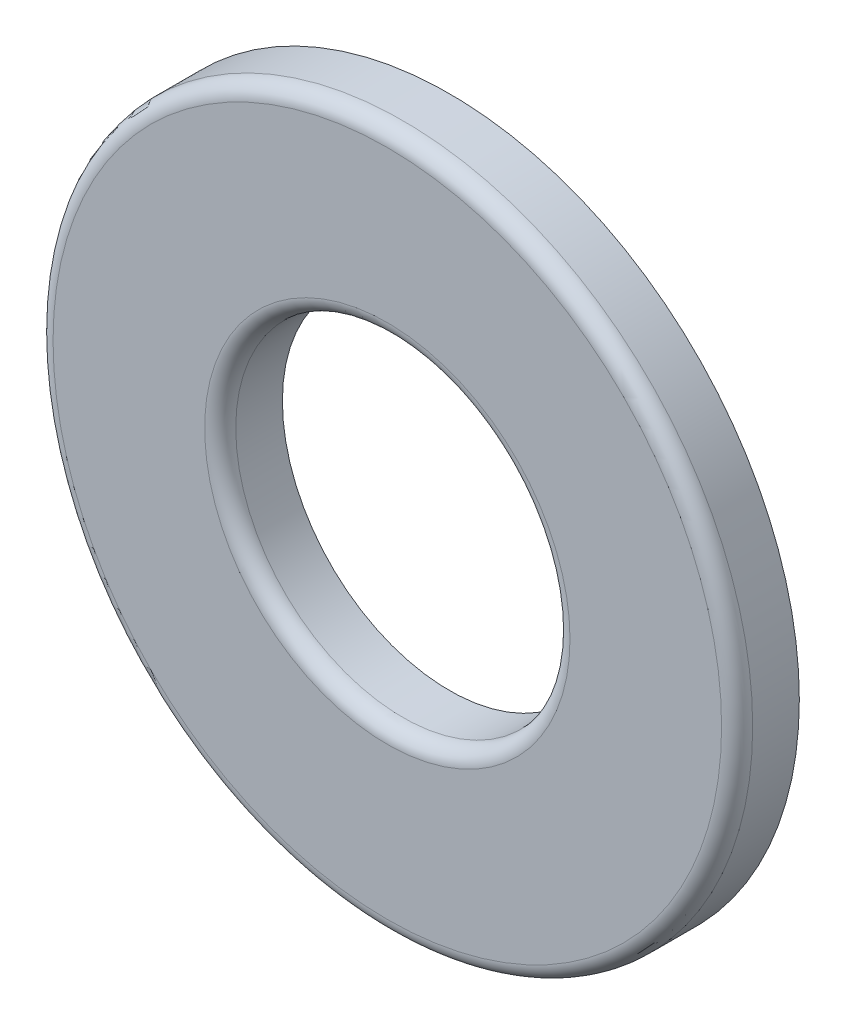
ISO-10303-21;
HEADER;
FILE_DESCRIPTION(('STEP AP214'),'2;1');
FILE_NAME('part.step','',(''),(''),'','','');
FILE_SCHEMA(('AUTOMOTIVE_DESIGN { 1 0 10303 214 1 1 1 1 }'));
ENDSEC;
DATA;
#1=APPLICATION_CONTEXT('core data for automotive mechanical design processes');
#2=APPLICATION_PROTOCOL_DEFINITION('international standard','automotive_design',2000,#1);
#3=PRODUCT_CONTEXT('',#1,'mechanical');
#4=PRODUCT('Part','Part','',(#3));
#5=PRODUCT_RELATED_PRODUCT_CATEGORY('part','',(#4));
#6=PRODUCT_DEFINITION_FORMATION('','',#4);
#7=PRODUCT_DEFINITION_CONTEXT('part definition',#1,'design');
#8=PRODUCT_DEFINITION('design','',#6,#7);
#9=PRODUCT_DEFINITION_SHAPE('','',#8);
#10=(LENGTH_UNIT() NAMED_UNIT(*) SI_UNIT(.MILLI.,.METRE.));
#11=(NAMED_UNIT(*) PLANE_ANGLE_UNIT() SI_UNIT($,.RADIAN.));
#12=(NAMED_UNIT(*) SI_UNIT($,.STERADIAN.) SOLID_ANGLE_UNIT());
#13=UNCERTAINTY_MEASURE_WITH_UNIT(LENGTH_MEASURE(1.E-05),#10,'distance_accuracy_value','');
#14=(GEOMETRIC_REPRESENTATION_CONTEXT(3) GLOBAL_UNCERTAINTY_ASSIGNED_CONTEXT((#13)) GLOBAL_UNIT_ASSIGNED_CONTEXT((#10,
#11,#12)) REPRESENTATION_CONTEXT('',''));
#15=CARTESIAN_POINT('',(0.,0.,0.));
#16=DIRECTION('',(0.,0.,1.));
#17=DIRECTION('',(1.,0.,0.));
#18=AXIS2_PLACEMENT_3D('',#15,#16,#17);
#19=CARTESIAN_POINT('',(0.,0.,0.6));
#20=DIRECTION('',(0.,0.,1.));
#21=DIRECTION('',(1.,0.,0.));
#22=AXIS2_PLACEMENT_3D('',#19,#20,#21);
#23=TOROIDAL_SURFACE('',#22,4.3,0.2);
#24=CARTESIAN_POINT('',(0.,0.,0.6));
#25=DIRECTION('',(0.,0.,1.));
#26=DIRECTION('',(1.,0.,0.));
#27=AXIS2_PLACEMENT_3D('',#24,#25,#26);
#28=CIRCLE('',#27,4.5);
#29=CARTESIAN_POINT('',(4.5,0.,0.6));
#30=VERTEX_POINT('',#29);
#31=EDGE_CURVE('E26',#30,#30,#28,.T.);
#32=ORIENTED_EDGE('',*,*,#31,.T.);
#33=CARTESIAN_POINT('',(4.3,0.,0.6));
#34=DIRECTION('',(0.,-1.,0.));
#35=DIRECTION('',(1.,0.,0.));
#36=AXIS2_PLACEMENT_3D('',#33,#34,#35);
#37=CIRCLE('',#36,0.2);
#38=CARTESIAN_POINT('',(4.3,0.,0.8));
#39=VERTEX_POINT('',#38);
#40=EDGE_CURVE('E10',#30,#39,#37,.T.);
#41=ORIENTED_EDGE('',*,*,#40,.T.);
#42=CARTESIAN_POINT('',(0.,0.,0.8));
#43=DIRECTION('',(0.,0.,1.));
#44=DIRECTION('',(1.,0.,0.));
#45=AXIS2_PLACEMENT_3D('',#42,#43,#44);
#46=CIRCLE('',#45,4.3);
#47=EDGE_CURVE('E94',#39,#39,#46,.T.);
#48=ORIENTED_EDGE('',*,*,#47,.F.);
#49=ORIENTED_EDGE('',*,*,#40,.F.);
#50=EDGE_LOOP('',(#32,#41,#48,#49));
#51=FACE_BOUND('',#50,.T.);
#52=ADVANCED_FACE('F15',(#51),#23,.T.);
#53=CARTESIAN_POINT('',(0.,0.,0.));
#54=DIRECTION('',(0.,0.,1.));
#55=DIRECTION('',(1.,0.,0.));
#56=AXIS2_PLACEMENT_3D('',#53,#54,#55);
#57=CYLINDRICAL_SURFACE('',#56,4.5);
#58=CARTESIAN_POINT('',(0.,0.,0.));
#59=DIRECTION('',(0.,0.,1.));
#60=DIRECTION('',(1.,0.,0.));
#61=AXIS2_PLACEMENT_3D('',#58,#59,#60);
#62=CIRCLE('',#61,4.5);
#63=CARTESIAN_POINT('',(4.5,0.,0.));
#64=VERTEX_POINT('',#63);
#65=EDGE_CURVE('E59',#64,#64,#62,.T.);
#66=ORIENTED_EDGE('',*,*,#65,.T.);
#67=DIRECTION('',(0.,0.,1.));
#68=VECTOR('',#67,1.);
#69=CARTESIAN_POINT('',(4.5,0.,0.));
#70=LINE('',#69,#68);
#71=EDGE_CURVE('E67',#64,#30,#70,.T.);
#72=ORIENTED_EDGE('',*,*,#71,.T.);
#73=ORIENTED_EDGE('',*,*,#31,.F.);
#74=ORIENTED_EDGE('',*,*,#71,.F.);
#75=EDGE_LOOP('',(#66,#72,#73,#74));
#76=FACE_BOUND('',#75,.T.);
#77=ADVANCED_FACE('F17',(#76),#57,.T.);
#78=CARTESIAN_POINT('',(0.,0.,0.));
#79=DIRECTION('',(0.,0.,1.));
#80=DIRECTION('',(1.,0.,0.));
#81=AXIS2_PLACEMENT_3D('',#78,#79,#80);
#82=PLANE('',#81);
#83=ORIENTED_EDGE('',*,*,#65,.F.);
#84=EDGE_LOOP('',(#83));
#85=FACE_BOUND('',#84,.T.);
#86=CARTESIAN_POINT('',(0.,0.,0.));
#87=DIRECTION('',(0.,0.,1.));
#88=DIRECTION('',(1.,0.,0.));
#89=AXIS2_PLACEMENT_3D('',#86,#87,#88);
#90=CIRCLE('',#89,2.15);
#91=CARTESIAN_POINT('',(2.15,0.,0.));
#92=VERTEX_POINT('',#91);
#93=EDGE_CURVE('E19',#92,#92,#90,.T.);
#94=ORIENTED_EDGE('',*,*,#93,.T.);
#95=EDGE_LOOP('',(#94));
#96=FACE_BOUND('',#95,.T.);
#97=ADVANCED_FACE('F55',(#85,#96),#82,.F.);
#98=CARTESIAN_POINT('',(0.,0.,0.6));
#99=DIRECTION('',(0.,0.,-1.));
#100=DIRECTION('',(1.,0.,0.));
#101=AXIS2_PLACEMENT_3D('',#98,#99,#100);
#102=CYLINDRICAL_SURFACE('',#101,2.15);
#103=CARTESIAN_POINT('',(0.,0.,0.6));
#104=DIRECTION('',(0.,0.,1.));
#105=DIRECTION('',(1.,0.,0.));
#106=AXIS2_PLACEMENT_3D('',#103,#104,#105);
#107=CIRCLE('',#106,2.15);
#108=CARTESIAN_POINT('',(2.15,0.,0.6));
#109=VERTEX_POINT('',#108);
#110=EDGE_CURVE('E69',#109,#109,#107,.T.);
#111=ORIENTED_EDGE('',*,*,#110,.T.);
#112=DIRECTION('',(0.,0.,-1.));
#113=VECTOR('',#112,1.);
#114=CARTESIAN_POINT('',(2.15,0.,0.6));
#115=LINE('',#114,#113);
#116=EDGE_CURVE('E60',#109,#92,#115,.T.);
#117=ORIENTED_EDGE('',*,*,#116,.T.);
#118=ORIENTED_EDGE('',*,*,#93,.F.);
#119=ORIENTED_EDGE('',*,*,#116,.F.);
#120=EDGE_LOOP('',(#111,#117,#118,#119));
#121=FACE_BOUND('',#120,.T.);
#122=ADVANCED_FACE('F116',(#121),#102,.F.);
#123=CARTESIAN_POINT('',(0.,0.,0.6));
#124=DIRECTION('',(0.,0.,1.));
#125=DIRECTION('',(1.,0.,0.));
#126=AXIS2_PLACEMENT_3D('',#123,#124,#125);
#127=TOROIDAL_SURFACE('',#126,2.35,0.2);
#128=CARTESIAN_POINT('',(0.,0.,0.8));
#129=DIRECTION('',(0.,0.,1.));
#130=DIRECTION('',(1.,0.,0.));
#131=AXIS2_PLACEMENT_3D('',#128,#129,#130);
#132=CIRCLE('',#131,2.35);
#133=CARTESIAN_POINT('',(2.35,0.,0.8));
#134=VERTEX_POINT('',#133);
#135=EDGE_CURVE('E79',#134,#134,#132,.T.);
#136=ORIENTED_EDGE('',*,*,#135,.T.);
#137=CARTESIAN_POINT('',(2.35,0.,0.6));
#138=DIRECTION('',(0.,-1.,0.));
#139=DIRECTION('',(1.,0.,0.));
#140=AXIS2_PLACEMENT_3D('',#137,#138,#139);
#141=CIRCLE('',#140,0.2);
#142=EDGE_CURVE('E75',#134,#109,#141,.T.);
#143=ORIENTED_EDGE('',*,*,#142,.T.);
#144=ORIENTED_EDGE('',*,*,#110,.F.);
#145=ORIENTED_EDGE('',*,*,#142,.F.);
#146=EDGE_LOOP('',(#136,#143,#144,#145));
#147=FACE_BOUND('',#146,.T.);
#148=ADVANCED_FACE('F106',(#147),#127,.T.);
#149=CARTESIAN_POINT('',(0.,0.,0.8));
#150=DIRECTION('',(0.,0.,1.));
#151=DIRECTION('',(1.,0.,0.));
#152=AXIS2_PLACEMENT_3D('',#149,#150,#151);
#153=PLANE('',#152);
#154=ORIENTED_EDGE('',*,*,#135,.F.);
#155=EDGE_LOOP('',(#154));
#156=FACE_BOUND('',#155,.T.);
#157=ORIENTED_EDGE('',*,*,#47,.T.);
#158=EDGE_LOOP('',(#157));
#159=FACE_BOUND('',#158,.T.);
#160=ADVANCED_FACE('F109',(#156,#159),#153,.T.);
#161=CLOSED_SHELL('',(#52,#77,#97,#122,#148,#160));
#162=MANIFOLD_SOLID_BREP('B1',#161);
#163=ADVANCED_BREP_SHAPE_REPRESENTATION('',(#18,#162),#14);
#164=SHAPE_DEFINITION_REPRESENTATION(#9,#163);
ENDSEC;
END-ISO-10303-21;
